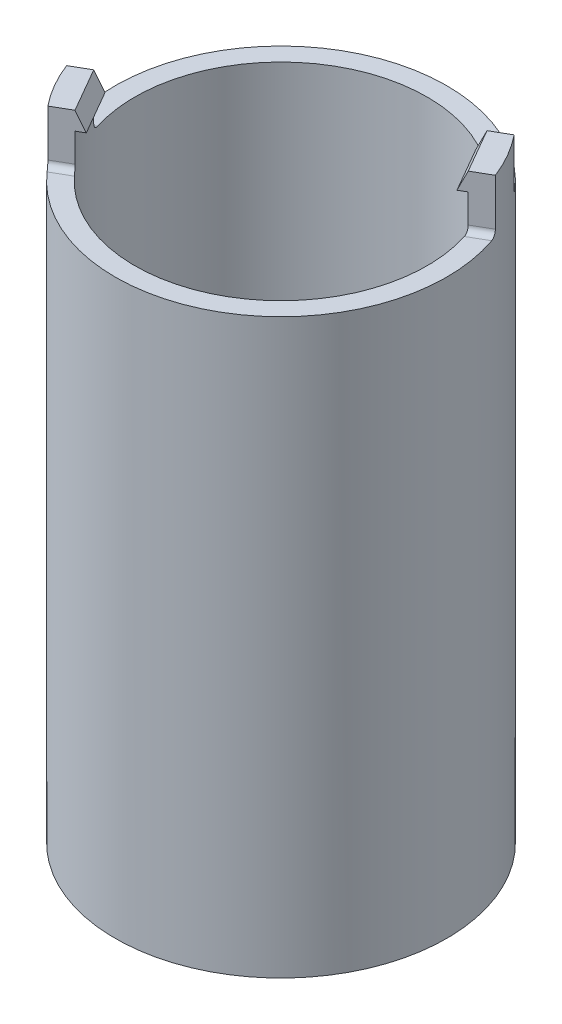
ISO-10303-21;
HEADER;
FILE_DESCRIPTION(('STEP AP214'),'2;1');
FILE_NAME('part.step','',(''),(''),'','','');
FILE_SCHEMA(('AUTOMOTIVE_DESIGN { 1 0 10303 214 1 1 1 1 }'));
ENDSEC;
DATA;
#1=APPLICATION_CONTEXT('core data for automotive mechanical design processes');
#2=APPLICATION_PROTOCOL_DEFINITION('international standard','automotive_design',2000,#1);
#3=PRODUCT_CONTEXT('',#1,'mechanical');
#4=PRODUCT('Part','Part','',(#3));
#5=PRODUCT_RELATED_PRODUCT_CATEGORY('part','',(#4));
#6=PRODUCT_DEFINITION_FORMATION('','',#4);
#7=PRODUCT_DEFINITION_CONTEXT('part definition',#1,'design');
#8=PRODUCT_DEFINITION('design','',#6,#7);
#9=PRODUCT_DEFINITION_SHAPE('','',#8);
#10=(LENGTH_UNIT() NAMED_UNIT(*) SI_UNIT(.MILLI.,.METRE.));
#11=(NAMED_UNIT(*) PLANE_ANGLE_UNIT() SI_UNIT($,.RADIAN.));
#12=(NAMED_UNIT(*) SI_UNIT($,.STERADIAN.) SOLID_ANGLE_UNIT());
#13=UNCERTAINTY_MEASURE_WITH_UNIT(LENGTH_MEASURE(1.E-05),#10,'distance_accuracy_value','');
#14=(GEOMETRIC_REPRESENTATION_CONTEXT(3) GLOBAL_UNCERTAINTY_ASSIGNED_CONTEXT((#13)) GLOBAL_UNIT_ASSIGNED_CONTEXT((#10,
#11,#12)) REPRESENTATION_CONTEXT('',''));
#15=CARTESIAN_POINT('',(0.,0.,0.));
#16=DIRECTION('',(0.,0.,1.));
#17=DIRECTION('',(1.,0.,0.));
#18=AXIS2_PLACEMENT_3D('',#15,#16,#17);
#19=CARTESIAN_POINT('',(-0.424997768368668,128.789324240472,-0.736122881645696));
#20=DIRECTION('',(-0.499997374551125,0.,-0.866026919582747));
#21=DIRECTION('',(-0.866026919582747,0.,0.499997374551125));
#22=AXIS2_PLACEMENT_3D('',#19,#20,#21);
#23=PLANE('',#22);
#24=DIRECTION('',(0.,-1.,0.));
#25=VECTOR('',#24,1.);
#26=CARTESIAN_POINT('',(-4.56021963183331,128.789324240472,1.65133185927074));
#27=LINE('',#26,#25);
#28=CARTESIAN_POINT('',(-4.5602196318333,125.144845223857,1.65133185927074));
#29=VERTEX_POINT('',#28);
#30=CARTESIAN_POINT('',(-4.5602196318333,124.194845223848,1.65133185927074));
#31=VERTEX_POINT('',#30);
#32=EDGE_CURVE('E291',#29,#31,#27,.T.);
#33=ORIENTED_EDGE('',*,*,#32,.T.);
#34=DIRECTION('',(-0.866026919582747,0.,0.499997374551125));
#35=VECTOR('',#34,1.);
#36=CARTESIAN_POINT('',(-0.424997768368668,124.194845223848,-0.736122881645696));
#37=LINE('',#36,#35);
#38=CARTESIAN_POINT('',(-5.13091983771242,124.194845223848,1.98082346991588));
#39=VERTEX_POINT('',#38);
#40=EDGE_CURVE('E328',#31,#39,#37,.T.);
#41=ORIENTED_EDGE('',*,*,#40,.T.);
#42=DIRECTION('',(0.,-1.,0.));
#43=VECTOR('',#42,1.);
#44=CARTESIAN_POINT('',(-5.13091983771242,128.789324240472,1.98082346991588));
#45=LINE('',#44,#43);
#46=CARTESIAN_POINT('',(-5.13091983771242,125.744845223848,1.98082346991588));
#47=VERTEX_POINT('',#46);
#48=EDGE_CURVE('E294',#47,#39,#45,.T.);
#49=ORIENTED_EDGE('',*,*,#48,.F.);
#50=DIRECTION('',(0.866026919582718,0.,-0.499997374551176));
#51=VECTOR('',#50,1.);
#52=CARTESIAN_POINT('',(-0.42499776836868,125.744845223848,-0.736122881645622));
#53=LINE('',#52,#51);
#54=CARTESIAN_POINT('',(-4.5602196318333,125.744845223848,1.65133185927072));
#55=VERTEX_POINT('',#54);
#56=EDGE_CURVE('E284',#47,#55,#53,.T.);
#57=ORIENTED_EDGE('',*,*,#56,.T.);
#58=DIRECTION('',(-0.360763226041642,0.909102378053209,0.20828528741615));
#59=VECTOR('',#58,1.);
#60=CARTESIAN_POINT('',(-4.32211890649109,125.144845223857,1.5138653038344));
#61=LINE('',#60,#59);
#62=CARTESIAN_POINT('',(-4.32211890649109,125.144845223857,1.5138653038344));
#63=VERTEX_POINT('',#62);
#64=EDGE_CURVE('E322',#63,#55,#61,.T.);
#65=ORIENTED_EDGE('',*,*,#64,.F.);
#66=DIRECTION('',(0.866026919582747,0.,-0.499997374551125));
#67=VECTOR('',#66,1.);
#68=CARTESIAN_POINT('',(-4.32211890649111,125.144845223857,1.51386530383442));
#69=LINE('',#68,#67);
#70=EDGE_CURVE('E316',#29,#63,#69,.T.);
#71=ORIENTED_EDGE('',*,*,#70,.F.);
#72=EDGE_LOOP('',(#33,#41,#49,#57,#65,#71));
#73=FACE_BOUND('',#72,.T.);
#74=ADVANCED_FACE('F56',(#73),#23,.T.);
#75=CARTESIAN_POINT('',(0.424997768368445,0.,0.736122881645227));
#76=DIRECTION('',(-0.49999737455117,0.,-0.866026919582721));
#77=DIRECTION('',(-0.866026919582721,0.,0.49999737455117));
#78=AXIS2_PLACEMENT_3D('',#75,#76,#77);
#79=PLANE('',#78);
#80=DIRECTION('',(0.,-1.,0.));
#81=VECTOR('',#80,1.);
#82=CARTESIAN_POINT('',(-4.28092430097546,128.789324240472,3.45306923320652));
#83=LINE('',#82,#81);
#84=CARTESIAN_POINT('',(-4.28092430098085,125.744845223848,3.45306923321087));
#85=VERTEX_POINT('',#84);
#86=CARTESIAN_POINT('',(-4.28092430097545,124.194845223848,3.45306923320652));
#87=VERTEX_POINT('',#86);
#88=EDGE_CURVE('E260',#85,#87,#83,.T.);
#89=ORIENTED_EDGE('',*,*,#88,.T.);
#90=DIRECTION('',(-0.866026919582721,0.,0.49999737455117));
#91=VECTOR('',#90,1.);
#92=CARTESIAN_POINT('',(-3.71022409510209,124.194845223848,3.1235776225649));
#93=LINE('',#92,#91);
#94=CARTESIAN_POINT('',(-3.71022409509633,124.194845223848,3.12357762256138));
#95=VERTEX_POINT('',#94);
#96=EDGE_CURVE('E344',#87,#95,#93,.F.);
#97=ORIENTED_EDGE('',*,*,#96,.T.);
#98=DIRECTION('',(0.,-1.,0.));
#99=VECTOR('',#98,1.);
#100=CARTESIAN_POINT('',(-3.71022409509633,128.789324240472,3.12357762256138));
#101=LINE('',#100,#99);
#102=CARTESIAN_POINT('',(-3.71022409509633,125.144845223857,3.12357762256138));
#103=VERTEX_POINT('',#102);
#104=EDGE_CURVE('E287',#103,#95,#101,.T.);
#105=ORIENTED_EDGE('',*,*,#104,.F.);
#106=DIRECTION('',(0.866026919582721,0.,-0.49999737455117));
#107=VECTOR('',#106,1.);
#108=CARTESIAN_POINT('',(-3.47212336975384,125.144845223857,2.98611106712547));
#109=LINE('',#108,#107);
#110=CARTESIAN_POINT('',(-3.47212336975384,125.144845223857,2.98611106712547));
#111=VERTEX_POINT('',#110);
#112=EDGE_CURVE('E312',#103,#111,#109,.T.);
#113=ORIENTED_EDGE('',*,*,#112,.T.);
#114=DIRECTION('',(-0.360763226041632,0.909102378053208,0.208285287416168));
#115=VECTOR('',#114,1.);
#116=CARTESIAN_POINT('',(-3.47212336975384,125.144845223857,2.98611106712547));
#117=LINE('',#116,#115);
#118=CARTESIAN_POINT('',(-3.71022409509624,125.744845223857,3.12357762256152));
#119=VERTEX_POINT('',#118);
#120=EDGE_CURVE('E313',#111,#119,#117,.T.);
#121=ORIENTED_EDGE('',*,*,#120,.T.);
#122=DIRECTION('',(0.866026919582743,0.,-0.499997374551132));
#123=VECTOR('',#122,1.);
#124=CARTESIAN_POINT('',(0.424997768368419,125.744845223848,0.73612288164526));
#125=LINE('',#124,#123);
#126=EDGE_CURVE('E286',#85,#119,#125,.T.);
#127=ORIENTED_EDGE('',*,*,#126,.F.);
#128=EDGE_LOOP('',(#89,#97,#105,#113,#121,#127));
#129=FACE_BOUND('',#128,.T.);
#130=ADVANCED_FACE('F466',(#129),#79,.F.);
#131=CARTESIAN_POINT('',(-4.65211301053592,125.144845223857,0.942294747763077));
#132=DIRECTION('',(0.,-1.,0.));
#133=DIRECTION('',(0.,0.,-1.));
#134=AXIS2_PLACEMENT_3D('',#131,#132,#133);
#135=PLANE('',#134);
#136=ORIENTED_EDGE('',*,*,#112,.F.);
#137=CARTESIAN_POINT('',(-6.57608998750967E-12,125.144845223857,-1.2901761457357E-11));
#138=DIRECTION('',(0.,1.,0.));
#139=DIRECTION('',(0.,0.,1.));
#140=AXIS2_PLACEMENT_3D('',#137,#138,#139);
#141=CIRCLE('',#140,4.85000000000988);
#142=EDGE_CURVE('E309',#103,#29,#141,.F.);
#143=ORIENTED_EDGE('',*,*,#142,.T.);
#144=ORIENTED_EDGE('',*,*,#70,.T.);
#145=DIRECTION('',(0.49999737455117,0.,0.866026919582721));
#146=VECTOR('',#145,1.);
#147=CARTESIAN_POINT('',(-4.65211301053592,125.144845223857,0.942294747763077));
#148=LINE('',#147,#146);
#149=EDGE_CURVE('E321',#63,#111,#148,.T.);
#150=ORIENTED_EDGE('',*,*,#149,.T.);
#151=EDGE_LOOP('',(#136,#143,#144,#150));
#152=FACE_BOUND('',#151,.T.);
#153=ADVANCED_FACE('F471',(#152),#135,.T.);
#154=CARTESIAN_POINT('',(-4.65211301053592,125.144845223857,0.942294747763077));
#155=DIRECTION('',(0.787307132050746,0.416572762213279,-0.45454880222483));
#156=DIRECTION('',(-0.49999737455117,0.,-0.866026919582721));
#157=AXIS2_PLACEMENT_3D('',#154,#155,#156);
#158=PLANE('',#157);
#159=ORIENTED_EDGE('',*,*,#149,.F.);
#160=ORIENTED_EDGE('',*,*,#64,.T.);
#161=DIRECTION('',(0.49999737455117,0.,0.866026919582721));
#162=VECTOR('',#161,1.);
#163=CARTESIAN_POINT('',(-4.89021373587833,125.744845223857,1.07976130319913));
#164=LINE('',#163,#162);
#165=EDGE_CURVE('E325',#55,#119,#164,.T.);
#166=ORIENTED_EDGE('',*,*,#165,.T.);
#167=ORIENTED_EDGE('',*,*,#120,.F.);
#168=EDGE_LOOP('',(#159,#160,#166,#167));
#169=FACE_BOUND('',#168,.T.);
#170=ADVANCED_FACE('F476',(#169),#158,.T.);
#171=CARTESIAN_POINT('',(-7.26275084961786,125.744845223848,2.44953665437015));
#172=DIRECTION('',(0.,-1.,0.));
#173=DIRECTION('',(0.,0.,-1.));
#174=AXIS2_PLACEMENT_3D('',#171,#172,#173);
#175=PLANE('',#174);
#176=ORIENTED_EDGE('',*,*,#165,.F.);
#177=ORIENTED_EDGE('',*,*,#56,.F.);
#178=CARTESIAN_POINT('',(-6.57638375568138E-12,125.744845223848,-1.2901600253943E-11));
#179=DIRECTION('',(0.,-1.,0.));
#180=DIRECTION('',(1.,0.,0.));
#181=AXIS2_PLACEMENT_3D('',#178,#179,#180);
#182=CIRCLE('',#181,5.50000000000988);
#183=EDGE_CURVE('E281',#47,#85,#182,.F.);
#184=ORIENTED_EDGE('',*,*,#183,.T.);
#185=ORIENTED_EDGE('',*,*,#126,.T.);
#186=EDGE_LOOP('',(#176,#177,#184,#185));
#187=FACE_BOUND('',#186,.T.);
#188=ADVANCED_FACE('F404',(#187),#175,.F.);
#189=CARTESIAN_POINT('',(-6.56720350031519E-12,106.994845223848,-1.29066378606288E-11));
#190=DIRECTION('',(0.,1.,0.));
#191=DIRECTION('',(-1.,0.,0.));
#192=AXIS2_PLACEMENT_3D('',#189,#190,#191);
#193=CYLINDRICAL_SURFACE('',#192,4.85000000000988);
#194=CARTESIAN_POINT('',(-6.56720350031519E-12,106.994845223848,-1.29066378606288E-11));
#195=DIRECTION('',(0.,-1.,0.));
#196=DIRECTION('',(0.,0.,-1.));
#197=AXIS2_PLACEMENT_3D('',#194,#195,#196);
#198=CIRCLE('',#197,4.85000000000988);
#199=CARTESIAN_POINT('',(-6.56720350031519E-12,106.994845223848,-4.85000000002279));
#200=VERTEX_POINT('',#199);
#201=EDGE_CURVE('E243',#200,#200,#198,.T.);
#202=ORIENTED_EDGE('',*,*,#201,.T.);
#203=EDGE_LOOP('',(#202));
#204=FACE_BOUND('',#203,.T.);
#205=ORIENTED_EDGE('',*,*,#32,.F.);
#206=ORIENTED_EDGE('',*,*,#142,.F.);
#207=ORIENTED_EDGE('',*,*,#104,.T.);
#208=CARTESIAN_POINT('',(-3.71022409509625,124.194845223848,3.12357762256153));
#209=CARTESIAN_POINT('',(-3.71022978031443,124.183728702244,3.12356917859004));
#210=CARTESIAN_POINT('',(-3.70961819980027,124.172615837748,3.12429728795478));
#211=CARTESIAN_POINT('',(-3.70720301016843,124.150718691505,3.1271635934594));
#212=CARTESIAN_POINT('',(-3.70540078433494,124.139934043631,3.12930015326422));
#213=CARTESIAN_POINT('',(-3.70064576838714,124.118983597079,3.13492162270589));
#214=CARTESIAN_POINT('',(-3.69769256243372,124.108818023605,3.13840701966267));
#215=CARTESIAN_POINT('',(-3.69071564488503,124.089393121027,3.14660882478176));
#216=CARTESIAN_POINT('',(-3.68669201603355,124.080133721951,3.15132513779358));
#217=CARTESIAN_POINT('',(-3.67765350576537,124.062721581967,3.16186858923862));
#218=CARTESIAN_POINT('',(-3.67263309393158,124.054575463961,3.16770191844889));
#219=CARTESIAN_POINT('',(-3.66174732575104,124.039666656603,3.18027916687181));
#220=CARTESIAN_POINT('',(-3.65588180767493,124.032904232652,3.1870232603634));
#221=CARTESIAN_POINT('',(-3.64336679175024,124.020844718876,3.20132315327177));
#222=CARTESIAN_POINT('',(-3.6367068508733,124.01557113904,3.20888961393662));
#223=CARTESIAN_POINT('',(-3.6228521241949,124.00675511621,3.22452343732498));
#224=CARTESIAN_POINT('',(-3.61565746619477,124.003212261081,3.23259068028236));
#225=CARTESIAN_POINT('',(-3.60297327013438,123.998668127565,3.24671326605819));
#226=CARTESIAN_POINT('',(-3.59756435012126,123.997234445236,3.25270594682838));
#227=CARTESIAN_POINT('',(-3.58664923953205,123.995323052092,3.26473796133704));
#228=CARTESIAN_POINT('',(-3.58114321055338,123.994843881064,3.27077720960441));
#229=CARTESIAN_POINT('',(-3.57561964475843,123.994845223847,3.2768039544771));
#230=B_SPLINE_CURVE_WITH_KNOTS('',3,(#208,#209,#210,#211,#212,#213,#214,#215,#216,#217,#218,
#219,#220,#221,#222,#223,#224,#225,#226,#227,#228,#229),.UNSPECIFIED.,.F.,.F.,(4,2,2,2,2,2,2,2,
2,2,4),(0.,0.033303573993095,0.0665685239867018,0.0998455034753643,0.133119911397219,
0.166584370809874,0.200055242898235,0.234028347261773,0.267993357753905,0.29253671324345,
0.317042493311294),.UNSPECIFIED.);
#231=CARTESIAN_POINT('',(-3.57561964475809,123.994845223848,3.27680395447735));
#232=VERTEX_POINT('',#231);
#233=EDGE_CURVE('E410',#95,#232,#230,.T.);
#234=ORIENTED_EDGE('',*,*,#233,.T.);
#235=CARTESIAN_POINT('',(-6.5755269318472E-12,123.994845223848,-1.29020704305671E-11));
#236=DIRECTION('',(0.,-1.,0.));
#237=DIRECTION('',(0.,0.,-1.));
#238=AXIS2_PLACEMENT_3D('',#235,#236,#237);
#239=CIRCLE('',#238,4.85000000000988);
#240=CARTESIAN_POINT('',(4.62561413131672,123.994845223848,-1.45814742335463));
#241=VERTEX_POINT('',#240);
#242=EDGE_CURVE('E302',#241,#232,#239,.T.);
#243=ORIENTED_EDGE('',*,*,#242,.F.);
#244=CARTESIAN_POINT('',(4.62561413131672,123.994845223848,-1.45814742335463));
#245=CARTESIAN_POINT('',(4.62211158193394,123.994836182288,-1.46926381387669));
#246=CARTESIAN_POINT('',(4.6185658777938,123.995815813008,-1.48036668289824));
#247=CARTESIAN_POINT('',(4.61149726911449,123.999698584849,-1.50223860522396));
#248=CARTESIAN_POINT('',(4.60797436513651,124.002601773135,-1.51300765033634));
#249=CARTESIAN_POINT('',(4.60105757839592,124.01028122959,-1.53391385596496));
#250=CARTESIAN_POINT('',(4.59766381299328,124.015059158921,-1.54405044682207));
#251=CARTESIAN_POINT('',(4.59112673604546,124.026363749635,-1.56338068630894));
#252=CARTESIAN_POINT('',(4.58798331306372,124.032889627235,-1.57257475501916));
#253=CARTESIAN_POINT('',(4.58210228300826,124.047413893733,-1.58962861759903));
#254=CARTESIAN_POINT('',(4.5793596314806,124.055390496939,-1.59750521861001));
#255=CARTESIAN_POINT('',(4.57433249692593,124.072656810032,-1.61184369023683));
#256=CARTESIAN_POINT('',(4.57204809397751,124.081946748941,-1.61830531360447));
#257=CARTESIAN_POINT('',(4.56806692746549,124.101386138938,-1.62950893632958));
#258=CARTESIAN_POINT('',(4.56636004316469,124.111516434786,-1.6342806291892));
#259=CARTESIAN_POINT('',(4.56354521267779,124.132488914251,-1.64212441626296));
#260=CARTESIAN_POINT('',(4.56243677441284,124.143330504747,-1.64519790689138));
#261=CARTESIAN_POINT('',(4.56117483356641,124.161020018133,-1.6486922179243));
#262=CARTESIAN_POINT('',(4.56081695642353,124.167746839474,-1.64968163917329));
#263=CARTESIAN_POINT('',(4.56033936535157,124.181263144379,-1.65100122311883));
#264=CARTESIAN_POINT('',(4.56021930053781,124.188052520751,-1.65133235710041));
#265=CARTESIAN_POINT('',(4.56021963184047,124.194845223848,-1.65133185927597));
#266=B_SPLINE_CURVE_WITH_KNOTS('',3,(#244,#245,#246,#247,#248,#249,#250,#251,#252,#253,#254,
#255,#256,#257,#258,#259,#260,#261,#262,#263,#264,#265),.UNSPECIFIED.,.F.,.F.,(4,2,2,2,2,2,2,2,
2,2,4),(0.,0.0349246165875949,0.069850089522506,0.10480657916004,0.139747420388408,
0.174201381590948,0.208661358361635,0.242481684859619,0.276274159704366,0.296666744520734,
0.317029218232846),.UNSPECIFIED.);
#267=CARTESIAN_POINT('',(4.56021963183306,124.194845223848,-1.65133185927114));
#268=VERTEX_POINT('',#267);
#269=EDGE_CURVE('E12',#241,#268,#266,.T.);
#270=ORIENTED_EDGE('',*,*,#269,.T.);
#271=DIRECTION('',(0.,-1.,0.));
#272=VECTOR('',#271,1.);
#273=CARTESIAN_POINT('',(4.56021963183306,128.789324240472,-1.65133185927114));
#274=LINE('',#273,#272);
#275=CARTESIAN_POINT('',(4.56021963183307,125.144845223857,-1.65133185927112));
#276=VERTEX_POINT('',#275);
#277=EDGE_CURVE('E273',#276,#268,#274,.T.);
#278=ORIENTED_EDGE('',*,*,#277,.F.);
#279=CARTESIAN_POINT('',(-6.57608998750967E-12,125.144845223857,-1.2901761457357E-11));
#280=DIRECTION('',(0.,1.,0.));
#281=DIRECTION('',(0.,0.,1.));
#282=AXIS2_PLACEMENT_3D('',#279,#280,#281);
#283=CIRCLE('',#282,4.85000000000988);
#284=CARTESIAN_POINT('',(3.7102240950961,125.144845223857,-3.12357762256178));
#285=VERTEX_POINT('',#284);
#286=EDGE_CURVE('E257',#285,#276,#283,.F.);
#287=ORIENTED_EDGE('',*,*,#286,.F.);
#288=DIRECTION('',(0.,-1.,0.));
#289=VECTOR('',#288,1.);
#290=CARTESIAN_POINT('',(3.71022409509609,128.789324240472,-3.12357762256178));
#291=LINE('',#290,#289);
#292=CARTESIAN_POINT('',(3.7102240950961,124.194845223848,-3.12357762256178));
#293=VERTEX_POINT('',#292);
#294=EDGE_CURVE('E267',#285,#293,#291,.T.);
#295=ORIENTED_EDGE('',*,*,#294,.T.);
#296=CARTESIAN_POINT('',(3.71022409509609,124.194845223848,-3.12357762256179));
#297=CARTESIAN_POINT('',(3.71022978031794,124.183728702244,-3.12356917859243));
#298=CARTESIAN_POINT('',(3.70961819980529,124.172615837747,-3.12429728795804));
#299=CARTESIAN_POINT('',(3.70720301017456,124.150718691505,-3.12716359346332));
#300=CARTESIAN_POINT('',(3.70540078434069,124.139934043631,-3.12930015326791));
#301=CARTESIAN_POINT('',(3.70064576839264,124.118983597079,-3.13492162270942));
#302=CARTESIAN_POINT('',(3.69769256243935,124.108818023605,-3.13840701966628));
#303=CARTESIAN_POINT('',(3.69071564489079,124.089393121027,-3.14660882478545));
#304=CARTESIAN_POINT('',(3.6866920160393,124.080133721951,-3.15132513779729));
#305=CARTESIAN_POINT('',(3.67765350577116,124.062721581967,-3.16186858924237));
#306=CARTESIAN_POINT('',(3.67263309393741,124.054575463961,-3.16770191845267));
#307=CARTESIAN_POINT('',(3.66174732575696,124.039666656603,-3.18027916687567));
#308=CARTESIAN_POINT('',(3.65588180768088,124.032904232652,-3.18702326036729));
#309=CARTESIAN_POINT('',(3.64336679175628,124.020844718876,-3.20132315327573));
#310=CARTESIAN_POINT('',(3.63670685087939,124.01557113904,-3.20888961394062));
#311=CARTESIAN_POINT('',(3.62285212420109,124.00675511621,-3.22452343732905));
#312=CARTESIAN_POINT('',(3.61565746620102,124.003212261081,-3.23259068028647));
#313=CARTESIAN_POINT('',(3.60297327014074,123.998668127565,-3.24671326606235));
#314=CARTESIAN_POINT('',(3.59756435012768,123.997234445236,-3.25270594683255));
#315=CARTESIAN_POINT('',(3.58664923953858,123.995323052092,-3.26473796134122));
#316=CARTESIAN_POINT('',(3.58114321055997,123.994843881064,-3.27077720960859));
#317=CARTESIAN_POINT('',(3.57561964476508,123.994845223847,-3.27680395448129));
#318=B_SPLINE_CURVE_WITH_KNOTS('',3,(#296,#297,#298,#299,#300,#301,#302,#303,#304,#305,#306,
#307,#308,#309,#310,#311,#312,#313,#314,#315,#316,#317),.UNSPECIFIED.,.F.,.F.,(4,2,2,2,2,2,2,2,
2,2,4),(0.,0.0333035739930948,0.0665685239866157,0.0998455034752587,0.133119911397154,
0.166584370809838,0.200055242898202,0.234028347261716,0.267993357753821,0.292536713243266,
0.317042493311003),.UNSPECIFIED.);
#319=CARTESIAN_POINT('',(3.57561964476474,123.994845223848,-3.27680395448154));
#320=VERTEX_POINT('',#319);
#321=EDGE_CURVE('E387',#293,#320,#318,.T.);
#322=ORIENTED_EDGE('',*,*,#321,.T.);
#323=CARTESIAN_POINT('',(-4.62561413132121,123.994845223848,1.45814742335629));
#324=VERTEX_POINT('',#323);
#325=EDGE_CURVE('E283',#324,#320,#239,.T.);
#326=ORIENTED_EDGE('',*,*,#325,.F.);
#327=CARTESIAN_POINT('',(-4.62561413132121,123.994845223848,1.45814742335629));
#328=CARTESIAN_POINT('',(-4.62211158193837,123.994836182288,1.46926381387832));
#329=CARTESIAN_POINT('',(-4.61856587779817,123.995815813008,1.48036668289982));
#330=CARTESIAN_POINT('',(-4.61149726911875,123.999698584849,1.50223860522545));
#331=CARTESIAN_POINT('',(-4.60797436514071,124.002601773135,1.51300765033779));
#332=CARTESIAN_POINT('',(-4.60105757840001,124.01028122959,1.53391385596632));
#333=CARTESIAN_POINT('',(-4.59766381299732,124.015059158921,1.54405044682339));
#334=CARTESIAN_POINT('',(-4.5911267360494,124.026363749635,1.56338068631018));
#335=CARTESIAN_POINT('',(-4.58798331306761,124.032889627235,1.57257475502035));
#336=CARTESIAN_POINT('',(-4.58210228301207,124.047413893733,1.58962861760017));
#337=CARTESIAN_POINT('',(-4.57935963148436,124.055390496939,1.59750521861112));
#338=CARTESIAN_POINT('',(-4.57433249692961,124.072656810032,1.6118436902379));
#339=CARTESIAN_POINT('',(-4.57204809398116,124.081946748941,1.61830531360552));
#340=CARTESIAN_POINT('',(-4.56806692746907,124.101386138938,1.62950893633061));
#341=CARTESIAN_POINT('',(-4.56636004316824,124.111516434786,1.63428062919022));
#342=CARTESIAN_POINT('',(-4.56354521268129,124.132488914251,1.64212441626397));
#343=CARTESIAN_POINT('',(-4.56243677441632,124.143330504747,1.6451979068924));
#344=CARTESIAN_POINT('',(-4.56117483356986,124.161020018132,1.64869221792533));
#345=CARTESIAN_POINT('',(-4.56081695642697,124.167746839474,1.64968163917432));
#346=CARTESIAN_POINT('',(-4.560339365355,124.181263144379,1.65100122311987));
#347=CARTESIAN_POINT('',(-4.56021930054124,124.188052520751,1.65133235710145));
#348=CARTESIAN_POINT('',(-4.56021963184389,124.194845223848,1.65133185927702));
#349=B_SPLINE_CURVE_WITH_KNOTS('',3,(#327,#328,#329,#330,#331,#332,#333,#334,#335,#336,#337,
#338,#339,#340,#341,#342,#343,#344,#345,#346,#347,#348),.UNSPECIFIED.,.F.,.F.,(4,2,2,2,2,2,2,2,
2,2,4),(0.,0.0349246165875197,0.0698500895223547,0.104806579159812,0.139747420388103,
0.174201381590593,0.208661358361239,0.242481684859218,0.276274159703944,0.296666744520358,
0.317029218232512),.UNSPECIFIED.);
#350=EDGE_CURVE('E356',#324,#31,#349,.T.);
#351=ORIENTED_EDGE('',*,*,#350,.T.);
#352=EDGE_LOOP('',(#205,#206,#207,#234,#243,#270,#278,#287,#295,#322,#326,#351));
#353=FACE_BOUND('',#352,.T.);
#354=ADVANCED_FACE('F399',(#204,#353),#193,.F.);
#355=CARTESIAN_POINT('',(0.,123.994845223848,0.));
#356=DIRECTION('',(0.,-1.,0.));
#357=DIRECTION('',(0.,0.,-1.));
#358=AXIS2_PLACEMENT_3D('',#355,#356,#357);
#359=PLANE('',#358);
#360=ORIENTED_EDGE('',*,*,#242,.T.);
#361=DIRECTION('',(-0.866026919582721,0.,0.49999737455117));
#362=VECTOR('',#361,1.);
#363=CARTESIAN_POINT('',(-4.1809248260712,123.994845223848,3.62627461712673));
#364=LINE('',#363,#362);
#365=CARTESIAN_POINT('',(-4.15054566906015,123.994845223848,3.60873532544522));
#366=VERTEX_POINT('',#365);
#367=EDGE_CURVE('E341',#232,#366,#364,.T.);
#368=ORIENTED_EDGE('',*,*,#367,.T.);
#369=CARTESIAN_POINT('',(-6.5755269318472E-12,123.994845223848,-1.29020704305671E-11));
#370=DIRECTION('',(0.,-1.,0.));
#371=DIRECTION('',(0.,0.,-1.));
#372=AXIS2_PLACEMENT_3D('',#369,#370,#371);
#373=CIRCLE('',#372,5.50000000000988);
#374=CARTESIAN_POINT('',(5.20054015561878,123.994845223848,-1.79007879432249));
#375=VERTEX_POINT('',#374);
#376=EDGE_CURVE('E306',#375,#366,#373,.T.);
#377=ORIENTED_EDGE('',*,*,#376,.F.);
#378=DIRECTION('',(0.866026919582721,0.,-0.49999737455117));
#379=VECTOR('',#378,1.);
#380=CARTESIAN_POINT('',(4.66021910675047,123.994845223848,-1.47812647535871));
#381=LINE('',#380,#379);
#382=EDGE_CURVE('E339',#375,#241,#381,.F.);
#383=ORIENTED_EDGE('',*,*,#382,.T.);
#384=EDGE_LOOP('',(#360,#368,#377,#383));
#385=FACE_BOUND('',#384,.T.);
#386=ADVANCED_FACE('F403',(#385),#359,.F.);
#387=CARTESIAN_POINT('',(-6.56720350031519E-12,106.994845223848,-1.29066378606288E-11));
#388=DIRECTION('',(0.,1.,0.));
#389=DIRECTION('',(-1.,0.,0.));
#390=AXIS2_PLACEMENT_3D('',#387,#388,#389);
#391=CYLINDRICAL_SURFACE('',#390,5.50000000000988);
#392=ORIENTED_EDGE('',*,*,#48,.T.);
#393=CARTESIAN_POINT('',(-5.13091983771261,124.194845223848,1.98082346991555));
#394=CARTESIAN_POINT('',(-5.1309153369542,124.183698497589,1.98083244772321));
#395=CARTESIAN_POINT('',(-5.13125929378169,124.172555250362,1.97994413820565));
#396=CARTESIAN_POINT('',(-5.13261063323528,124.150596952296,1.97643983383317));
#397=CARTESIAN_POINT('',(-5.13361730134307,124.139781561093,1.97382569970942));
#398=CARTESIAN_POINT('',(-5.13626121905407,124.118770808596,1.96693503599991));
#399=CARTESIAN_POINT('',(-5.13789871327756,124.108575689609,1.96265786151826));
#400=CARTESIAN_POINT('',(-5.141742005286,124.089095513002,1.95256712567455));
#401=CARTESIAN_POINT('',(-5.14394774654096,124.079810364984,1.94675371713767));
#402=CARTESIAN_POINT('',(-5.14885948977209,124.062364477245,1.93372553106641));
#403=CARTESIAN_POINT('',(-5.15156767461746,124.054208925984,1.92650463146998));
#404=CARTESIAN_POINT('',(-5.15738338008281,124.039288977382,1.91088095669605));
#405=CARTESIAN_POINT('',(-5.16049097775905,124.032524849136,1.90247795343293));
#406=CARTESIAN_POINT('',(-5.16703920447685,124.020494354256,1.88462124585115));
#407=CARTESIAN_POINT('',(-5.17048330696857,124.015246452531,1.87515639080121));
#408=CARTESIAN_POINT('',(-5.17756198377963,124.006488654348,1.85552165234109));
#409=CARTESIAN_POINT('',(-5.18119649772445,124.002978210631,1.84535199208002));
#410=CARTESIAN_POINT('',(-5.18746824428734,123.998537549873,1.82763069097905));
#411=CARTESIAN_POINT('',(-5.19008646639467,123.99715306916,1.82018264897671));
#412=CARTESIAN_POINT('',(-5.19532187873477,123.995306973961,1.80518540176007));
#413=CARTESIAN_POINT('',(-5.19793906460258,123.994843975362,1.79763636544247));
#414=CARTESIAN_POINT('',(-5.20054015562256,123.994845223847,1.79007879432411));
#415=B_SPLINE_CURVE_WITH_KNOTS('',3,(#393,#394,#395,#396,#397,#398,#399,#400,#401,#402,#403,
#404,#405,#406,#407,#408,#409,#410,#411,#412,#413,#414),.UNSPECIFIED.,.F.,.F.,(4,2,2,2,2,2,2,2,
2,2,4),(0.,0.0333944431126106,0.0667529400322048,0.10012438567396,0.133492512760257,
0.167009154961981,0.200532273056068,0.234447918447558,0.268352874399185,0.292347846237982,
0.316306749131513),.UNSPECIFIED.);
#416=CARTESIAN_POINT('',(-5.20054015562262,123.994845223848,1.79007879432374));
#417=VERTEX_POINT('',#416);
#418=EDGE_CURVE('E348',#39,#417,#415,.T.);
#419=ORIENTED_EDGE('',*,*,#418,.T.);
#420=CARTESIAN_POINT('',(4.15054566906615,123.994845223848,-3.608735325449));
#421=VERTEX_POINT('',#420);
#422=EDGE_CURVE('E305',#417,#421,#373,.T.);
#423=ORIENTED_EDGE('',*,*,#422,.T.);
#424=CARTESIAN_POINT('',(4.15054566906615,123.994845223848,-3.608735325449));
#425=CARTESIAN_POINT('',(4.15813294335083,123.994836062164,-3.60001105863842));
#426=CARTESIAN_POINT('',(4.16569020678093,123.995810782395,-3.59126150311733));
#427=CARTESIAN_POINT('',(4.18053962741056,123.9996702346,-3.57396337523335));
#428=CARTESIAN_POINT('',(4.18783182764884,124.00255465502,-3.56541477032213));
#429=CARTESIAN_POINT('',(4.201954251811,124.010178816748,-3.54876048359696));
#430=CARTESIAN_POINT('',(4.20878410419088,124.014920029901,-3.54065515898587));
#431=CARTESIAN_POINT('',(4.22178300289594,124.026130858737,-3.52514545059817));
#432=CARTESIAN_POINT('',(4.2279523020077,124.032599809897,-3.51774079880867));
#433=CARTESIAN_POINT('',(4.23939834621515,124.047013783069,-3.50393798937986));
#434=CARTESIAN_POINT('',(4.24468391506481,124.054942313469,-3.49752993259304));
#435=CARTESIAN_POINT('',(4.25429708875613,124.072101858261,-3.48583042595392));
#436=CARTESIAN_POINT('',(4.25862452081194,124.081333107089,-3.48053917750955));
#437=CARTESIAN_POINT('',(4.26614564686463,124.100689908999,-3.47131622893259));
#438=CARTESIAN_POINT('',(4.26935469484748,124.11080075549,-3.46736613762681));
#439=CARTESIAN_POINT('',(4.274636293779,124.131736747945,-3.46085282463197));
#440=CARTESIAN_POINT('',(4.27670971711197,124.14256133843,-3.45828853839076));
#441=CARTESIAN_POINT('',(4.27909814854277,124.16036200458,-3.45533226765559));
#442=CARTESIAN_POINT('',(4.27978270707853,124.167218199379,-3.45448416816262));
#443=CARTESIAN_POINT('',(4.28069560395009,124.180996966505,-3.45335276466543));
#444=CARTESIAN_POINT('',(4.28092460847064,124.187919427009,-3.4530686359333));
#445=CARTESIAN_POINT('',(4.28092430098725,124.194845223848,-3.45306923321318));
#446=B_SPLINE_CURVE_WITH_KNOTS('',3,(#424,#425,#426,#427,#428,#429,#430,#431,#432,#433,#434,
#435,#436,#437,#438,#439,#440,#441,#442,#443,#444,#445),.UNSPECIFIED.,.F.,.F.,(4,2,2,2,2,2,2,2,
2,2,4),(0.,0.0346442479678969,0.0692828453322955,0.103948955802565,0.138601752152128,
0.172884686095279,0.207173797433768,0.24097167644559,0.274743555456205,0.295535244889584,
0.316296506935292),.UNSPECIFIED.);
#447=CARTESIAN_POINT('',(4.28092430097522,124.194845223848,-3.45306923320691));
#448=VERTEX_POINT('',#447);
#449=EDGE_CURVE('E381',#421,#448,#446,.T.);
#450=ORIENTED_EDGE('',*,*,#449,.T.);
#451=DIRECTION('',(0.,-1.,0.));
#452=VECTOR('',#451,1.);
#453=CARTESIAN_POINT('',(4.28092430097522,128.789324240472,-3.45306923320691));
#454=LINE('',#453,#452);
#455=CARTESIAN_POINT('',(4.28092430098521,125.744845223848,-3.45306923321497));
#456=VERTEX_POINT('',#455);
#457=EDGE_CURVE('E278',#456,#448,#454,.T.);
#458=ORIENTED_EDGE('',*,*,#457,.F.);
#459=CARTESIAN_POINT('',(-6.57638375568138E-12,125.744845223848,-1.2901600253943E-11));
#460=DIRECTION('',(0.,-1.,0.));
#461=DIRECTION('',(1.,0.,0.));
#462=AXIS2_PLACEMENT_3D('',#459,#460,#461);
#463=CIRCLE('',#462,5.50000000000988);
#464=CARTESIAN_POINT('',(5.13091983771218,125.744845223848,-1.98082346991627));
#465=VERTEX_POINT('',#464);
#466=EDGE_CURVE('E270',#465,#456,#463,.F.);
#467=ORIENTED_EDGE('',*,*,#466,.F.);
#468=DIRECTION('',(0.,-1.,0.));
#469=VECTOR('',#468,1.);
#470=CARTESIAN_POINT('',(5.13091983771218,128.789324240472,-1.98082346991627));
#471=LINE('',#470,#469);
#472=CARTESIAN_POINT('',(5.13091983771218,124.194845223848,-1.98082346991627));
#473=VERTEX_POINT('',#472);
#474=EDGE_CURVE('E275',#465,#473,#471,.T.);
#475=ORIENTED_EDGE('',*,*,#474,.T.);
#476=CARTESIAN_POINT('',(5.13091983771218,124.194845223848,-1.98082346991627));
#477=CARTESIAN_POINT('',(5.13091533695218,124.183698497589,-1.98083244772301));
#478=CARTESIAN_POINT('',(5.13125929377901,124.172555250362,-1.97994413820508));
#479=CARTESIAN_POINT('',(5.1326106332321,124.150596952296,-1.97643983383231));
#480=CARTESIAN_POINT('',(5.13361730134005,124.139781561093,-1.97382569970866));
#481=CARTESIAN_POINT('',(5.13626121905115,124.118770808596,-1.96693503599921));
#482=CARTESIAN_POINT('',(5.13789871327457,124.108575689609,-1.96265786151751));
#483=CARTESIAN_POINT('',(5.14174200528292,124.089095513002,-1.95256712567377));
#484=CARTESIAN_POINT('',(5.14394774653787,124.079810364984,-1.94675371713688));
#485=CARTESIAN_POINT('',(5.14885948976894,124.062364477245,-1.93372553106561));
#486=CARTESIAN_POINT('',(5.15156767461427,124.054208925984,-1.92650463146917));
#487=CARTESIAN_POINT('',(5.15738338007953,124.039288977382,-1.91088095669521));
#488=CARTESIAN_POINT('',(5.16049097775573,124.032524849136,-1.90247795343207));
#489=CARTESIAN_POINT('',(5.16703920447344,124.020494354256,-1.88462124585026));
#490=CARTESIAN_POINT('',(5.17048330696511,124.015246452531,-1.87515639080029));
#491=CARTESIAN_POINT('',(5.17756198377606,124.006488654348,-1.85552165234014));
#492=CARTESIAN_POINT('',(5.18119649772084,124.002978210631,-1.84535199207905));
#493=CARTESIAN_POINT('',(5.18746824428364,123.998537549873,-1.82763069097801));
#494=CARTESIAN_POINT('',(5.19008646639095,123.99715306916,-1.82018264897563));
#495=CARTESIAN_POINT('',(5.19532187873099,123.995306973961,-1.80518540175891));
#496=CARTESIAN_POINT('',(5.19793906459877,123.994843975362,-1.79763636544126));
#497=CARTESIAN_POINT('',(5.20054015561872,123.994845223847,-1.79007879432286));
#498=B_SPLINE_CURVE_WITH_KNOTS('',3,(#476,#477,#478,#479,#480,#481,#482,#483,#484,#485,#486,
#487,#488,#489,#490,#491,#492,#493,#494,#495,#496,#497),.UNSPECIFIED.,.F.,.F.,(4,2,2,2,2,2,2,2,
2,2,4),(0.,0.0333944431125923,0.0667529400322148,0.100124385673986,0.133492512760239,
0.167009154961962,0.200532273056047,0.234447918447549,0.268352874399189,0.292347846238073,
0.3163067491317),.UNSPECIFIED.);
#499=EDGE_CURVE('E70',#473,#375,#498,.T.);
#500=ORIENTED_EDGE('',*,*,#499,.T.);
#501=ORIENTED_EDGE('',*,*,#376,.T.);
#502=CARTESIAN_POINT('',(-4.15054566906015,123.994845223848,3.60873532544522));
#503=CARTESIAN_POINT('',(-4.15813294334489,123.994836062164,3.60001105863466));
#504=CARTESIAN_POINT('',(-4.16569020677505,123.995810782395,3.5912615031136));
#505=CARTESIAN_POINT('',(-4.1805396274048,123.9996702346,3.57396337522967));
#506=CARTESIAN_POINT('',(-4.18783182764314,124.00255465502,3.56541477031848));
#507=CARTESIAN_POINT('',(-4.2019542518054,124.010178816748,3.54876048359336));
#508=CARTESIAN_POINT('',(-4.20878410418533,124.014920029902,3.54065515898229));
#509=CARTESIAN_POINT('',(-4.22178300289051,124.026130858737,3.52514545059463));
#510=CARTESIAN_POINT('',(-4.22795230200231,124.032599809898,3.51774079880515));
#511=CARTESIAN_POINT('',(-4.23939834620985,124.04701378307,3.50393798937638));
#512=CARTESIAN_POINT('',(-4.24468391505955,124.054942313469,3.49752993258958));
#513=CARTESIAN_POINT('',(-4.25429708875093,124.072101858261,3.4858304259505));
#514=CARTESIAN_POINT('',(-4.25862452080678,124.081333107089,3.48053917750616));
#515=CARTESIAN_POINT('',(-4.26614564685952,124.100689908999,3.47131622892923));
#516=CARTESIAN_POINT('',(-4.26935469484239,124.11080075549,3.46736613762347));
#517=CARTESIAN_POINT('',(-4.27463629377393,124.131736747945,3.46085282462867));
#518=CARTESIAN_POINT('',(-4.27670971710691,124.14256133843,3.45828853838747));
#519=CARTESIAN_POINT('',(-4.27909814853772,124.16036200458,3.45533226765232));
#520=CARTESIAN_POINT('',(-4.27978270707348,124.167218199379,3.45448416815936));
#521=CARTESIAN_POINT('',(-4.28069560394504,124.180996966505,3.45335276466219));
#522=CARTESIAN_POINT('',(-4.28092460846558,124.187919427009,3.45306863593006));
#523=CARTESIAN_POINT('',(-4.28092430098219,124.194845223848,3.45306923320995));
#524=B_SPLINE_CURVE_WITH_KNOTS('',3,(#502,#503,#504,#505,#506,#507,#508,#509,#510,#511,#512,
#513,#514,#515,#516,#517,#518,#519,#520,#521,#522,#523),.UNSPECIFIED.,.F.,.F.,(4,2,2,2,2,2,2,2,
2,2,4),(0.,0.0346442479679583,0.0692828453324117,0.103948955802739,0.138601752152364,
0.172884686095553,0.20717379743407,0.240971676445913,0.274743555456536,0.295535244889927,
0.316296506935648),.UNSPECIFIED.);
#525=EDGE_CURVE('E393',#366,#87,#524,.T.);
#526=ORIENTED_EDGE('',*,*,#525,.T.);
#527=ORIENTED_EDGE('',*,*,#88,.F.);
#528=ORIENTED_EDGE('',*,*,#183,.F.);
#529=EDGE_LOOP('',(#392,#419,#423,#450,#458,#467,#475,#500,#501,#526,#527,#528));
#530=FACE_BOUND('',#529,.T.);
#531=CARTESIAN_POINT('',(-6.56622427307613E-12,104.994845223848,-1.2907175205342E-11));
#532=DIRECTION('',(0.,-1.,0.));
#533=DIRECTION('',(0.,0.,-1.));
#534=AXIS2_PLACEMENT_3D('',#531,#532,#533);
#535=CIRCLE('',#534,5.50000000000988);
#536=CARTESIAN_POINT('',(-6.56622427307613E-12,104.994845223848,-5.50000000002279));
#537=VERTEX_POINT('',#536);
#538=EDGE_CURVE('E219',#537,#537,#535,.T.);
#539=ORIENTED_EDGE('',*,*,#538,.F.);
#540=EDGE_LOOP('',(#539));
#541=FACE_BOUND('',#540,.T.);
#542=ADVANCED_FACE('F362',(#530,#541),#391,.T.);
#543=ORIENTED_EDGE('',*,*,#422,.F.);
#544=DIRECTION('',(-0.866026919582747,0.,0.499997374551125));
#545=VECTOR('',#544,1.);
#546=CARTESIAN_POINT('',(-0.524997243278891,123.994845223848,-0.909328265562247));
#547=LINE('',#546,#545);
#548=EDGE_CURVE('E335',#417,#324,#547,.F.);
#549=ORIENTED_EDGE('',*,*,#548,.T.);
#550=ORIENTED_EDGE('',*,*,#325,.T.);
#551=DIRECTION('',(0.866026919582747,0.,-0.499997374551125));
#552=VECTOR('',#551,1.);
#553=CARTESIAN_POINT('',(-0.524997243278891,123.994845223848,-0.909328265562247));
#554=LINE('',#553,#552);
#555=EDGE_CURVE('E332',#320,#421,#554,.T.);
#556=ORIENTED_EDGE('',*,*,#555,.T.);
#557=EDGE_LOOP('',(#543,#549,#550,#556));
#558=FACE_BOUND('',#557,.T.);
#559=ADVANCED_FACE('F456',(#558),#359,.F.);
#560=CARTESIAN_POINT('',(-0.424997768368668,128.789324240472,-0.736122881645696));
#561=DIRECTION('',(-0.499997374551125,0.,-0.866026919582747));
#562=DIRECTION('',(-0.866026919582747,0.,0.499997374551125));
#563=AXIS2_PLACEMENT_3D('',#560,#561,#562);
#564=PLANE('',#563);
#565=ORIENTED_EDGE('',*,*,#457,.T.);
#566=DIRECTION('',(0.866026919582747,0.,-0.499997374551125));
#567=VECTOR('',#566,1.);
#568=CARTESIAN_POINT('',(-0.424997768368668,124.194845223848,-0.736122881645696));
#569=LINE('',#568,#567);
#570=EDGE_CURVE('E337',#448,#293,#569,.F.);
#571=ORIENTED_EDGE('',*,*,#570,.T.);
#572=ORIENTED_EDGE('',*,*,#294,.F.);
#573=DIRECTION('',(0.866026919582747,0.,-0.499997374551125));
#574=VECTOR('',#573,1.);
#575=CARTESIAN_POINT('',(3.47212336975361,125.144845223857,-2.98611106712571));
#576=LINE('',#575,#574);
#577=CARTESIAN_POINT('',(3.47212336975364,125.144845223857,-2.98611106712573));
#578=VERTEX_POINT('',#577);
#579=EDGE_CURVE('E249',#578,#285,#576,.T.);
#580=ORIENTED_EDGE('',*,*,#579,.F.);
#581=DIRECTION('',(-0.360763226046014,-0.909102378050895,0.208285287418674));
#582=VECTOR('',#581,1.);
#583=CARTESIAN_POINT('',(3.47212336975364,125.144845223857,-2.98611106712572));
#584=LINE('',#583,#582);
#585=CARTESIAN_POINT('',(3.71022409509605,125.744845223848,-3.12357762256177));
#586=VERTEX_POINT('',#585);
#587=EDGE_CURVE('E246',#586,#578,#584,.T.);
#588=ORIENTED_EDGE('',*,*,#587,.F.);
#589=DIRECTION('',(-0.866026919582747,0.,0.499997374551125));
#590=VECTOR('',#589,1.);
#591=CARTESIAN_POINT('',(-0.424997768368667,125.744845223848,-0.736122881645697));
#592=LINE('',#591,#590);
#593=EDGE_CURVE('E266',#456,#586,#592,.T.);
#594=ORIENTED_EDGE('',*,*,#593,.F.);
#595=EDGE_LOOP('',(#565,#571,#572,#580,#588,#594));
#596=FACE_BOUND('',#595,.T.);
#597=ADVANCED_FACE('F435',(#596),#564,.T.);
#598=CARTESIAN_POINT('',(0.424997768368424,128.789324240472,0.736122881645196));
#599=DIRECTION('',(-0.49999737455117,0.,-0.866026919582721));
#600=DIRECTION('',(-0.866026919582721,0.,0.49999737455117));
#601=AXIS2_PLACEMENT_3D('',#598,#599,#600);
#602=PLANE('',#601);
#603=ORIENTED_EDGE('',*,*,#277,.T.);
#604=DIRECTION('',(0.866026919582721,0.,-0.49999737455117));
#605=VECTOR('',#604,1.);
#606=CARTESIAN_POINT('',(5.13091983771219,124.194845223848,-1.98082346991627));
#607=LINE('',#606,#605);
#608=EDGE_CURVE('E346',#268,#473,#607,.T.);
#609=ORIENTED_EDGE('',*,*,#608,.T.);
#610=ORIENTED_EDGE('',*,*,#474,.F.);
#611=DIRECTION('',(-0.866026919582721,0.,0.49999737455117));
#612=VECTOR('',#611,1.);
#613=CARTESIAN_POINT('',(0.424997768368426,125.744845223848,0.736122881645195));
#614=LINE('',#613,#612);
#615=CARTESIAN_POINT('',(4.56021963183306,125.744845223848,-1.65133185927111));
#616=VERTEX_POINT('',#615);
#617=EDGE_CURVE('E263',#465,#616,#614,.T.);
#618=ORIENTED_EDGE('',*,*,#617,.T.);
#619=DIRECTION('',(-0.360763226046003,-0.909102378050895,0.208285287418693));
#620=VECTOR('',#619,1.);
#621=CARTESIAN_POINT('',(4.32211890649065,125.144845223857,-1.51386530383506));
#622=LINE('',#621,#620);
#623=CARTESIAN_POINT('',(4.32211890649065,125.144845223857,-1.51386530383506));
#624=VERTEX_POINT('',#623);
#625=EDGE_CURVE('E252',#616,#624,#622,.T.);
#626=ORIENTED_EDGE('',*,*,#625,.T.);
#627=DIRECTION('',(0.866026919582721,0.,-0.499997374551169));
#628=VECTOR('',#627,1.);
#629=CARTESIAN_POINT('',(4.32211890649065,125.144845223857,-1.51386530383506));
#630=LINE('',#629,#628);
#631=EDGE_CURVE('E251',#624,#276,#630,.T.);
#632=ORIENTED_EDGE('',*,*,#631,.T.);
#633=EDGE_LOOP('',(#603,#609,#610,#618,#626,#632));
#634=FACE_BOUND('',#633,.T.);
#635=ADVANCED_FACE('F427',(#634),#602,.F.);
#636=CARTESIAN_POINT('',(-6.59676140043781E-12,125.744845223848,-1.27550403026138E-11));
#637=DIRECTION('',(0.,-1.,0.));
#638=DIRECTION('',(-0.902294682028909,0.,0.431119828797458));
#639=AXIS2_PLACEMENT_3D('',#636,#637,#638);
#640=PLANE('',#639);
#641=ORIENTED_EDGE('',*,*,#593,.T.);
#642=DIRECTION('',(0.49999737455117,0.,0.866026919582721));
#643=VECTOR('',#642,1.);
#644=CARTESIAN_POINT('',(3.71022409509803,125.744845223848,-3.12357762256291));
#645=LINE('',#644,#643);
#646=EDGE_CURVE('E255',#586,#616,#645,.T.);
#647=ORIENTED_EDGE('',*,*,#646,.T.);
#648=ORIENTED_EDGE('',*,*,#617,.F.);
#649=ORIENTED_EDGE('',*,*,#466,.T.);
#650=EDGE_LOOP('',(#641,#647,#648,#649));
#651=FACE_BOUND('',#650,.T.);
#652=ADVANCED_FACE('F440',(#651),#640,.F.);
#653=CARTESIAN_POINT('',(6.93275674557394,125.144845223857,-3.02110721044291));
#654=DIRECTION('',(0.,1.,0.));
#655=DIRECTION('',(0.,0.,1.));
#656=AXIS2_PLACEMENT_3D('',#653,#654,#655);
#657=PLANE('',#656);
#658=ORIENTED_EDGE('',*,*,#286,.T.);
#659=ORIENTED_EDGE('',*,*,#631,.F.);
#660=DIRECTION('',(0.49999737455117,0.,0.866026919582721));
#661=VECTOR('',#660,1.);
#662=CARTESIAN_POINT('',(3.14212926570857,125.144845223857,-3.55768162319746));
#663=LINE('',#662,#661);
#664=EDGE_CURVE('E244',#578,#624,#663,.T.);
#665=ORIENTED_EDGE('',*,*,#664,.F.);
#666=ORIENTED_EDGE('',*,*,#579,.T.);
#667=EDGE_LOOP('',(#658,#659,#665,#666));
#668=FACE_BOUND('',#667,.T.);
#669=ADVANCED_FACE('F432',(#668),#657,.F.);
#670=CARTESIAN_POINT('',(3.14212926570857,125.144845223857,-3.55768162319746));
#671=DIRECTION('',(-0.787307132048743,0.416572762218328,0.454548802223673));
#672=DIRECTION('',(0.49999737455117,0.,0.866026919582721));
#673=AXIS2_PLACEMENT_3D('',#670,#671,#672);
#674=PLANE('',#673);
#675=ORIENTED_EDGE('',*,*,#646,.F.);
#676=ORIENTED_EDGE('',*,*,#587,.T.);
#677=ORIENTED_EDGE('',*,*,#664,.T.);
#678=ORIENTED_EDGE('',*,*,#625,.F.);
#679=EDGE_LOOP('',(#675,#676,#677,#678));
#680=FACE_BOUND('',#679,.T.);
#681=ADVANCED_FACE('F371',(#680),#674,.T.);
#682=CARTESIAN_POINT('',(-0.524997243278893,124.194845223848,-0.909328265562246));
#683=DIRECTION('',(-0.866026919582747,0.,0.499997374551125));
#684=DIRECTION('',(0.499997374551125,0.,0.866026919582747));
#685=AXIS2_PLACEMENT_3D('',#682,#683,#684);
#686=CYLINDRICAL_SURFACE('',#685,0.2);
#687=ORIENTED_EDGE('',*,*,#350,.F.);
#688=ORIENTED_EDGE('',*,*,#548,.F.);
#689=ORIENTED_EDGE('',*,*,#418,.F.);
#690=ORIENTED_EDGE('',*,*,#40,.F.);
#691=EDGE_LOOP('',(#687,#688,#689,#690));
#692=FACE_BOUND('',#691,.T.);
#693=ADVANCED_FACE('F365',(#692),#686,.F.);
#694=CARTESIAN_POINT('',(-0.524997243278891,124.194845223848,-0.909328265562247));
#695=DIRECTION('',(0.866026919582747,0.,-0.499997374551125));
#696=DIRECTION('',(-0.499997374551125,0.,-0.866026919582747));
#697=AXIS2_PLACEMENT_3D('',#694,#695,#696);
#698=CYLINDRICAL_SURFACE('',#697,0.2);
#699=ORIENTED_EDGE('',*,*,#321,.F.);
#700=ORIENTED_EDGE('',*,*,#570,.F.);
#701=ORIENTED_EDGE('',*,*,#449,.F.);
#702=ORIENTED_EDGE('',*,*,#555,.F.);
#703=EDGE_LOOP('',(#699,#700,#701,#702));
#704=FACE_BOUND('',#703,.T.);
#705=ADVANCED_FACE('F370',(#704),#698,.F.);
#706=CARTESIAN_POINT('',(0.524997243278661,124.194845223848,0.909328265561741));
#707=DIRECTION('',(0.866026919582721,0.,-0.49999737455117));
#708=DIRECTION('',(-0.49999737455117,0.,-0.866026919582721));
#709=AXIS2_PLACEMENT_3D('',#706,#707,#708);
#710=CYLINDRICAL_SURFACE('',#709,0.2);
#711=ORIENTED_EDGE('',*,*,#233,.F.);
#712=ORIENTED_EDGE('',*,*,#96,.F.);
#713=ORIENTED_EDGE('',*,*,#525,.F.);
#714=ORIENTED_EDGE('',*,*,#367,.F.);
#715=EDGE_LOOP('',(#711,#712,#713,#714));
#716=FACE_BOUND('',#715,.T.);
#717=ADVANCED_FACE('F377',(#716),#710,.F.);
#718=CARTESIAN_POINT('',(0.524997243278658,124.194845223848,0.90932826556174));
#719=DIRECTION('',(-0.866026919582721,0.,0.49999737455117));
#720=DIRECTION('',(0.49999737455117,0.,0.866026919582721));
#721=AXIS2_PLACEMENT_3D('',#718,#719,#720);
#722=CYLINDRICAL_SURFACE('',#721,0.2);
#723=ORIENTED_EDGE('',*,*,#269,.F.);
#724=ORIENTED_EDGE('',*,*,#382,.F.);
#725=ORIENTED_EDGE('',*,*,#499,.F.);
#726=ORIENTED_EDGE('',*,*,#608,.F.);
#727=EDGE_LOOP('',(#723,#724,#725,#726));
#728=FACE_BOUND('',#727,.T.);
#729=ADVANCED_FACE('F58',(#728),#722,.F.);
#730=CARTESIAN_POINT('',(-6.56720350031519E-12,106.994845223848,-1.29066378606288E-11));
#731=DIRECTION('',(0.,-1.,0.));
#732=DIRECTION('',(0.,0.,-1.));
#733=AXIS2_PLACEMENT_3D('',#730,#731,#732);
#734=PLANE('',#733);
#735=DIRECTION('',(0.,0.,-1.));
#736=VECTOR('',#735,1.);
#737=CARTESIAN_POINT('',(-3.00000000000412,106.994845223848,0.));
#738=LINE('',#737,#736);
#739=CARTESIAN_POINT('',(-3.00000000000412,106.994845223848,2.99999999999127));
#740=VERTEX_POINT('',#739);
#741=CARTESIAN_POINT('',(-3.00000000000412,106.994845223848,-3.00000000000873));
#742=VERTEX_POINT('',#741);
#743=EDGE_CURVE('E229',#740,#742,#738,.T.);
#744=ORIENTED_EDGE('',*,*,#743,.T.);
#745=DIRECTION('',(-1.,0.,0.));
#746=VECTOR('',#745,1.);
#747=CARTESIAN_POINT('',(0.,106.994845223848,-3.00000000000873));
#748=LINE('',#747,#746);
#749=CARTESIAN_POINT('',(2.99999999999588,106.994845223848,-3.00000000000873));
#750=VERTEX_POINT('',#749);
#751=EDGE_CURVE('E217',#750,#742,#748,.T.);
#752=ORIENTED_EDGE('',*,*,#751,.F.);
#753=DIRECTION('',(0.,0.,-1.));
#754=VECTOR('',#753,1.);
#755=CARTESIAN_POINT('',(2.99999999999588,106.994845223848,0.));
#756=LINE('',#755,#754);
#757=CARTESIAN_POINT('',(2.99999999999588,106.994845223848,2.99999999999127));
#758=VERTEX_POINT('',#757);
#759=EDGE_CURVE('E232',#758,#750,#756,.T.);
#760=ORIENTED_EDGE('',*,*,#759,.F.);
#761=DIRECTION('',(-1.,0.,0.));
#762=VECTOR('',#761,1.);
#763=CARTESIAN_POINT('',(0.,106.994845223848,2.99999999999127));
#764=LINE('',#763,#762);
#765=EDGE_CURVE('E210',#758,#740,#764,.T.);
#766=ORIENTED_EDGE('',*,*,#765,.T.);
#767=EDGE_LOOP('',(#744,#752,#760,#766));
#768=FACE_BOUND('',#767,.T.);
#769=ORIENTED_EDGE('',*,*,#201,.F.);
#770=EDGE_LOOP('',(#769));
#771=FACE_BOUND('',#770,.T.);
#772=ADVANCED_FACE('F499',(#768,#771),#734,.F.);
#773=CARTESIAN_POINT('',(-6.56622427307613E-12,104.994845223848,-1.2907175205342E-11));
#774=DIRECTION('',(0.,-1.,0.));
#775=DIRECTION('',(0.,0.,-1.));
#776=AXIS2_PLACEMENT_3D('',#773,#774,#775);
#777=PLANE('',#776);
#778=ORIENTED_EDGE('',*,*,#538,.T.);
#779=EDGE_LOOP('',(#778));
#780=FACE_BOUND('',#779,.T.);
#781=DIRECTION('',(-1.,0.,0.));
#782=VECTOR('',#781,1.);
#783=CARTESIAN_POINT('',(0.,104.994845223848,-3.00000000000873));
#784=LINE('',#783,#782);
#785=CARTESIAN_POINT('',(2.99999999999588,104.994845223848,-3.00000000000873));
#786=VERTEX_POINT('',#785);
#787=CARTESIAN_POINT('',(-3.00000000000412,104.994845223848,-3.00000000000873));
#788=VERTEX_POINT('',#787);
#789=EDGE_CURVE('E209',#786,#788,#784,.T.);
#790=ORIENTED_EDGE('',*,*,#789,.T.);
#791=DIRECTION('',(0.,0.,-1.));
#792=VECTOR('',#791,1.);
#793=CARTESIAN_POINT('',(-3.00000000000412,104.994845223848,0.));
#794=LINE('',#793,#792);
#795=CARTESIAN_POINT('',(-3.00000000000412,104.994845223848,2.99999999999127));
#796=VERTEX_POINT('',#795);
#797=EDGE_CURVE('E199',#796,#788,#794,.T.);
#798=ORIENTED_EDGE('',*,*,#797,.F.);
#799=DIRECTION('',(-1.,0.,0.));
#800=VECTOR('',#799,1.);
#801=CARTESIAN_POINT('',(0.,104.994845223848,2.99999999999127));
#802=LINE('',#801,#800);
#803=CARTESIAN_POINT('',(2.99999999999588,104.994845223848,2.99999999999127));
#804=VERTEX_POINT('',#803);
#805=EDGE_CURVE('E225',#804,#796,#802,.T.);
#806=ORIENTED_EDGE('',*,*,#805,.F.);
#807=DIRECTION('',(0.,0.,-1.));
#808=VECTOR('',#807,1.);
#809=CARTESIAN_POINT('',(2.99999999999588,104.994845223848,0.));
#810=LINE('',#809,#808);
#811=EDGE_CURVE('E223',#804,#786,#810,.T.);
#812=ORIENTED_EDGE('',*,*,#811,.T.);
#813=EDGE_LOOP('',(#790,#798,#806,#812));
#814=FACE_BOUND('',#813,.T.);
#815=ADVANCED_FACE('F222',(#780,#814),#777,.T.);
#816=CARTESIAN_POINT('',(-3.00000000000412,104.994845223848,0.));
#817=DIRECTION('',(1.,0.,0.));
#818=DIRECTION('',(0.,1.,0.));
#819=AXIS2_PLACEMENT_3D('',#816,#817,#818);
#820=PLANE('',#819);
#821=ORIENTED_EDGE('',*,*,#743,.F.);
#822=DIRECTION('',(0.,1.,0.));
#823=VECTOR('',#822,1.);
#824=CARTESIAN_POINT('',(-3.00000000000412,104.994845223848,2.99999999999127));
#825=LINE('',#824,#823);
#826=EDGE_CURVE('E205',#796,#740,#825,.T.);
#827=ORIENTED_EDGE('',*,*,#826,.F.);
#828=ORIENTED_EDGE('',*,*,#797,.T.);
#829=DIRECTION('',(0.,1.,0.));
#830=VECTOR('',#829,1.);
#831=CARTESIAN_POINT('',(-3.00000000000412,104.994845223848,-3.00000000000873));
#832=LINE('',#831,#830);
#833=EDGE_CURVE('E202',#788,#742,#832,.T.);
#834=ORIENTED_EDGE('',*,*,#833,.T.);
#835=EDGE_LOOP('',(#821,#827,#828,#834));
#836=FACE_BOUND('',#835,.T.);
#837=ADVANCED_FACE('F201',(#836),#820,.T.);
#838=CARTESIAN_POINT('',(0.,104.994845223848,-3.00000000000873));
#839=DIRECTION('',(0.,0.,-1.));
#840=DIRECTION('',(0.,1.,0.));
#841=AXIS2_PLACEMENT_3D('',#838,#839,#840);
#842=PLANE('',#841);
#843=ORIENTED_EDGE('',*,*,#751,.T.);
#844=ORIENTED_EDGE('',*,*,#833,.F.);
#845=ORIENTED_EDGE('',*,*,#789,.F.);
#846=DIRECTION('',(0.,1.,0.));
#847=VECTOR('',#846,1.);
#848=CARTESIAN_POINT('',(2.99999999999588,104.994845223848,-3.00000000000873));
#849=LINE('',#848,#847);
#850=EDGE_CURVE('E220',#786,#750,#849,.T.);
#851=ORIENTED_EDGE('',*,*,#850,.T.);
#852=EDGE_LOOP('',(#843,#844,#845,#851));
#853=FACE_BOUND('',#852,.T.);
#854=ADVANCED_FACE('F214',(#853),#842,.F.);
#855=CARTESIAN_POINT('',(2.99999999999588,104.994845223848,0.));
#856=DIRECTION('',(1.,0.,0.));
#857=DIRECTION('',(0.,1.,0.));
#858=AXIS2_PLACEMENT_3D('',#855,#856,#857);
#859=PLANE('',#858);
#860=ORIENTED_EDGE('',*,*,#759,.T.);
#861=ORIENTED_EDGE('',*,*,#850,.F.);
#862=ORIENTED_EDGE('',*,*,#811,.F.);
#863=DIRECTION('',(0.,1.,0.));
#864=VECTOR('',#863,1.);
#865=CARTESIAN_POINT('',(2.99999999999588,104.994845223848,2.99999999999127));
#866=LINE('',#865,#864);
#867=EDGE_CURVE('E238',#804,#758,#866,.T.);
#868=ORIENTED_EDGE('',*,*,#867,.T.);
#869=EDGE_LOOP('',(#860,#861,#862,#868));
#870=FACE_BOUND('',#869,.T.);
#871=ADVANCED_FACE('F577',(#870),#859,.F.);
#872=CARTESIAN_POINT('',(0.,104.994845223848,2.99999999999127));
#873=DIRECTION('',(0.,0.,-1.));
#874=DIRECTION('',(0.,1.,0.));
#875=AXIS2_PLACEMENT_3D('',#872,#873,#874);
#876=PLANE('',#875);
#877=ORIENTED_EDGE('',*,*,#765,.F.);
#878=ORIENTED_EDGE('',*,*,#867,.F.);
#879=ORIENTED_EDGE('',*,*,#805,.T.);
#880=ORIENTED_EDGE('',*,*,#826,.T.);
#881=EDGE_LOOP('',(#877,#878,#879,#880));
#882=FACE_BOUND('',#881,.T.);
#883=ADVANCED_FACE('F586',(#882),#876,.T.);
#884=CLOSED_SHELL('',(#74,#130,#153,#170,#188,#354,#386,#542,#559,#597,#635,#652,#669,#681,#693,
#705,#717,#729,#772,#815,#837,#854,#871,#883));
#885=MANIFOLD_SOLID_BREP('B2',#884);
#886=ADVANCED_BREP_SHAPE_REPRESENTATION('',(#18,#885),#14);
#887=SHAPE_DEFINITION_REPRESENTATION(#9,#886);
ENDSEC;
END-ISO-10303-21;
